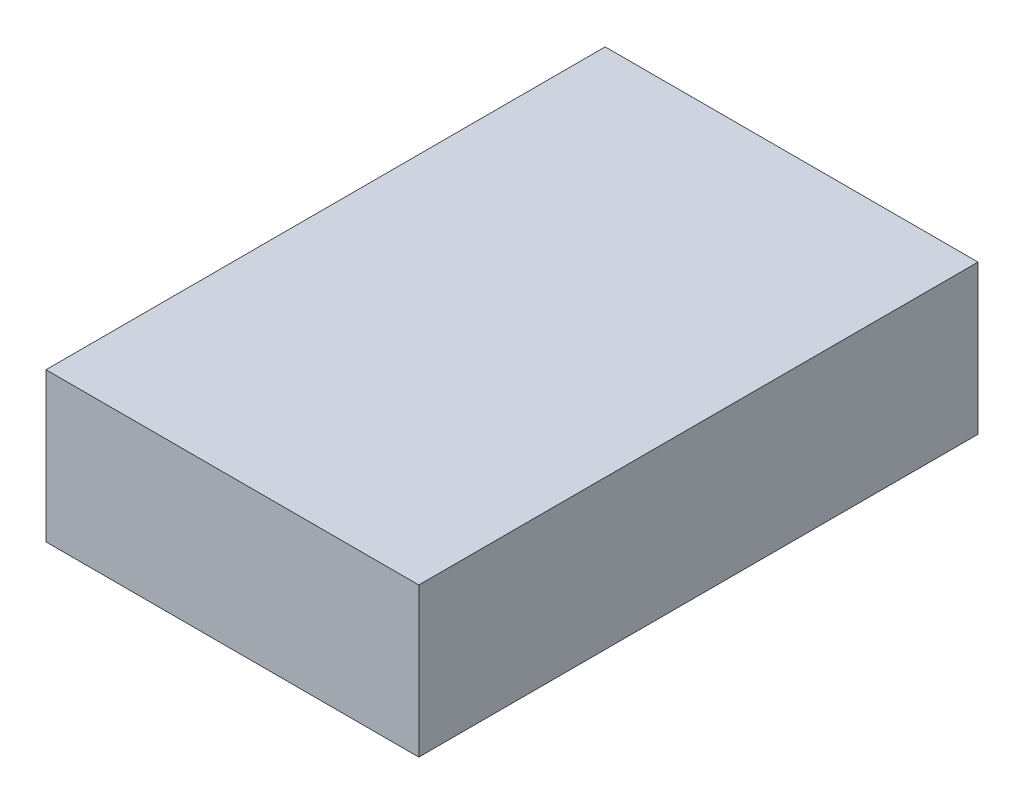
ISO-10303-21;
HEADER;
FILE_DESCRIPTION(('STEP AP214'),'2;1');
FILE_NAME('part.step','',(''),(''),'','','');
FILE_SCHEMA(('AUTOMOTIVE_DESIGN { 1 0 10303 214 1 1 1 1 }'));
ENDSEC;
DATA;
#1=APPLICATION_CONTEXT('core data for automotive mechanical design processes');
#2=APPLICATION_PROTOCOL_DEFINITION('international standard','automotive_design',2000,#1);
#3=PRODUCT_CONTEXT('',#1,'mechanical');
#4=PRODUCT('Part','Part','',(#3));
#5=PRODUCT_RELATED_PRODUCT_CATEGORY('part','',(#4));
#6=PRODUCT_DEFINITION_FORMATION('','',#4);
#7=PRODUCT_DEFINITION_CONTEXT('part definition',#1,'design');
#8=PRODUCT_DEFINITION('design','',#6,#7);
#9=PRODUCT_DEFINITION_SHAPE('','',#8);
#10=(LENGTH_UNIT() NAMED_UNIT(*) SI_UNIT(.MILLI.,.METRE.));
#11=(NAMED_UNIT(*) PLANE_ANGLE_UNIT() SI_UNIT($,.RADIAN.));
#12=(NAMED_UNIT(*) SI_UNIT($,.STERADIAN.) SOLID_ANGLE_UNIT());
#13=UNCERTAINTY_MEASURE_WITH_UNIT(LENGTH_MEASURE(1.E-05),#10,'distance_accuracy_value','');
#14=(GEOMETRIC_REPRESENTATION_CONTEXT(3) GLOBAL_UNCERTAINTY_ASSIGNED_CONTEXT((#13)) GLOBAL_UNIT_ASSIGNED_CONTEXT((#10,
#11,#12)) REPRESENTATION_CONTEXT('',''));
#15=CARTESIAN_POINT('',(0.,0.,0.));
#16=DIRECTION('',(0.,0.,1.));
#17=DIRECTION('',(1.,0.,0.));
#18=AXIS2_PLACEMENT_3D('',#15,#16,#17);
#19=CARTESIAN_POINT('',(1.,0.8,-1.5));
#20=DIRECTION('',(-1.,0.,0.));
#21=DIRECTION('',(0.,0.,1.));
#22=AXIS2_PLACEMENT_3D('',#19,#20,#21);
#23=PLANE('',#22);
#24=DIRECTION('',(0.,0.,-1.));
#25=VECTOR('',#24,1.);
#26=CARTESIAN_POINT('',(1.,0.,-1.5));
#27=LINE('',#26,#25);
#28=CARTESIAN_POINT('',(1.,0.,1.5));
#29=VERTEX_POINT('',#28);
#30=CARTESIAN_POINT('',(1.,0.,-1.5));
#31=VERTEX_POINT('',#30);
#32=EDGE_CURVE('E108',#29,#31,#27,.T.);
#33=ORIENTED_EDGE('',*,*,#32,.T.);
#34=DIRECTION('',(0.,-1.,0.));
#35=VECTOR('',#34,1.);
#36=CARTESIAN_POINT('',(1.,0.8,-1.5));
#37=LINE('',#36,#35);
#38=CARTESIAN_POINT('',(1.,0.8,-1.5));
#39=VERTEX_POINT('',#38);
#40=EDGE_CURVE('E11',#39,#31,#37,.T.);
#41=ORIENTED_EDGE('',*,*,#40,.F.);
#42=DIRECTION('',(0.,0.,-1.));
#43=VECTOR('',#42,1.);
#44=CARTESIAN_POINT('',(1.,0.8,-1.5));
#45=LINE('',#44,#43);
#46=CARTESIAN_POINT('',(1.,0.8,1.5));
#47=VERTEX_POINT('',#46);
#48=EDGE_CURVE('E96',#47,#39,#45,.T.);
#49=ORIENTED_EDGE('',*,*,#48,.F.);
#50=DIRECTION('',(0.,-1.,0.));
#51=VECTOR('',#50,1.);
#52=CARTESIAN_POINT('',(1.,0.8,1.5));
#53=LINE('',#52,#51);
#54=EDGE_CURVE('E104',#47,#29,#53,.T.);
#55=ORIENTED_EDGE('',*,*,#54,.T.);
#56=EDGE_LOOP('',(#33,#41,#49,#55));
#57=FACE_BOUND('',#56,.T.);
#58=ADVANCED_FACE('F45',(#57),#23,.F.);
#59=CARTESIAN_POINT('',(-1.,0.8,-1.5));
#60=DIRECTION('',(0.,0.,1.));
#61=DIRECTION('',(1.,0.,0.));
#62=AXIS2_PLACEMENT_3D('',#59,#60,#61);
#63=PLANE('',#62);
#64=DIRECTION('',(-1.,0.,0.));
#65=VECTOR('',#64,1.);
#66=CARTESIAN_POINT('',(-1.,0.,-1.5));
#67=LINE('',#66,#65);
#68=CARTESIAN_POINT('',(-1.,0.,-1.5));
#69=VERTEX_POINT('',#68);
#70=EDGE_CURVE('E100',#31,#69,#67,.T.);
#71=ORIENTED_EDGE('',*,*,#70,.T.);
#72=DIRECTION('',(0.,-1.,0.));
#73=VECTOR('',#72,1.);
#74=CARTESIAN_POINT('',(-1.,0.8,-1.5));
#75=LINE('',#74,#73);
#76=CARTESIAN_POINT('',(-1.,0.8,-1.5));
#77=VERTEX_POINT('',#76);
#78=EDGE_CURVE('E53',#77,#69,#75,.T.);
#79=ORIENTED_EDGE('',*,*,#78,.F.);
#80=DIRECTION('',(-1.,0.,0.));
#81=VECTOR('',#80,1.);
#82=CARTESIAN_POINT('',(-1.,0.8,-1.5));
#83=LINE('',#82,#81);
#84=EDGE_CURVE('E91',#39,#77,#83,.T.);
#85=ORIENTED_EDGE('',*,*,#84,.F.);
#86=ORIENTED_EDGE('',*,*,#40,.T.);
#87=EDGE_LOOP('',(#71,#79,#85,#86));
#88=FACE_BOUND('',#87,.T.);
#89=ADVANCED_FACE('F99',(#88),#63,.F.);
#90=CARTESIAN_POINT('',(-1.,0.8,-1.5));
#91=DIRECTION('',(1.,0.,0.));
#92=DIRECTION('',(0.,0.,-1.));
#93=AXIS2_PLACEMENT_3D('',#90,#91,#92);
#94=PLANE('',#93);
#95=DIRECTION('',(0.,0.,1.));
#96=VECTOR('',#95,1.);
#97=CARTESIAN_POINT('',(-1.,0.,-1.5));
#98=LINE('',#97,#96);
#99=CARTESIAN_POINT('',(-0.999999999999999,0.,1.5));
#100=VERTEX_POINT('',#99);
#101=EDGE_CURVE('E78',#69,#100,#98,.T.);
#102=ORIENTED_EDGE('',*,*,#101,.T.);
#103=DIRECTION('',(0.,-1.,0.));
#104=VECTOR('',#103,1.);
#105=CARTESIAN_POINT('',(-0.999999999999999,0.8,1.5));
#106=LINE('',#105,#104);
#107=CARTESIAN_POINT('',(-0.999999999999999,0.8,1.5));
#108=VERTEX_POINT('',#107);
#109=EDGE_CURVE('E101',#108,#100,#106,.T.);
#110=ORIENTED_EDGE('',*,*,#109,.F.);
#111=DIRECTION('',(0.,0.,1.));
#112=VECTOR('',#111,1.);
#113=CARTESIAN_POINT('',(-1.,0.8,-1.5));
#114=LINE('',#113,#112);
#115=EDGE_CURVE('E94',#77,#108,#114,.T.);
#116=ORIENTED_EDGE('',*,*,#115,.F.);
#117=ORIENTED_EDGE('',*,*,#78,.T.);
#118=EDGE_LOOP('',(#102,#110,#116,#117));
#119=FACE_BOUND('',#118,.T.);
#120=ADVANCED_FACE('F102',(#119),#94,.F.);
#121=CARTESIAN_POINT('',(-0.999999999999999,0.8,1.5));
#122=DIRECTION('',(0.,0.,-1.));
#123=DIRECTION('',(-1.,0.,0.));
#124=AXIS2_PLACEMENT_3D('',#121,#122,#123);
#125=PLANE('',#124);
#126=DIRECTION('',(1.,0.,0.));
#127=VECTOR('',#126,1.);
#128=CARTESIAN_POINT('',(-0.999999999999999,0.,1.5));
#129=LINE('',#128,#127);
#130=EDGE_CURVE('E84',#100,#29,#129,.T.);
#131=ORIENTED_EDGE('',*,*,#130,.T.);
#132=ORIENTED_EDGE('',*,*,#54,.F.);
#133=DIRECTION('',(1.,0.,0.));
#134=VECTOR('',#133,1.);
#135=CARTESIAN_POINT('',(-0.999999999999999,0.8,1.5));
#136=LINE('',#135,#134);
#137=EDGE_CURVE('E61',#108,#47,#136,.T.);
#138=ORIENTED_EDGE('',*,*,#137,.F.);
#139=ORIENTED_EDGE('',*,*,#109,.T.);
#140=EDGE_LOOP('',(#131,#132,#138,#139));
#141=FACE_BOUND('',#140,.T.);
#142=ADVANCED_FACE('F115',(#141),#125,.F.);
#143=CARTESIAN_POINT('',(0.,0.8,0.));
#144=DIRECTION('',(0.,1.,0.));
#145=DIRECTION('',(0.,0.,1.));
#146=AXIS2_PLACEMENT_3D('',#143,#144,#145);
#147=PLANE('',#146);
#148=ORIENTED_EDGE('',*,*,#48,.T.);
#149=ORIENTED_EDGE('',*,*,#84,.T.);
#150=ORIENTED_EDGE('',*,*,#115,.T.);
#151=ORIENTED_EDGE('',*,*,#137,.T.);
#152=EDGE_LOOP('',(#148,#149,#150,#151));
#153=FACE_BOUND('',#152,.T.);
#154=ADVANCED_FACE('F92',(#153),#147,.T.);
#155=CARTESIAN_POINT('',(0.,0.,0.));
#156=DIRECTION('',(0.,1.,0.));
#157=DIRECTION('',(0.,0.,1.));
#158=AXIS2_PLACEMENT_3D('',#155,#156,#157);
#159=PLANE('',#158);
#160=ORIENTED_EDGE('',*,*,#32,.F.);
#161=ORIENTED_EDGE('',*,*,#130,.F.);
#162=ORIENTED_EDGE('',*,*,#101,.F.);
#163=ORIENTED_EDGE('',*,*,#70,.F.);
#164=EDGE_LOOP('',(#160,#161,#162,#163));
#165=FACE_BOUND('',#164,.T.);
#166=ADVANCED_FACE('F118',(#165),#159,.F.);
#167=CLOSED_SHELL('',(#58,#89,#120,#142,#154,#166));
#168=MANIFOLD_SOLID_BREP('B2',#167);
#169=ADVANCED_BREP_SHAPE_REPRESENTATION('',(#18,#168),#14);
#170=SHAPE_DEFINITION_REPRESENTATION(#9,#169);
ENDSEC;
END-ISO-10303-21;
